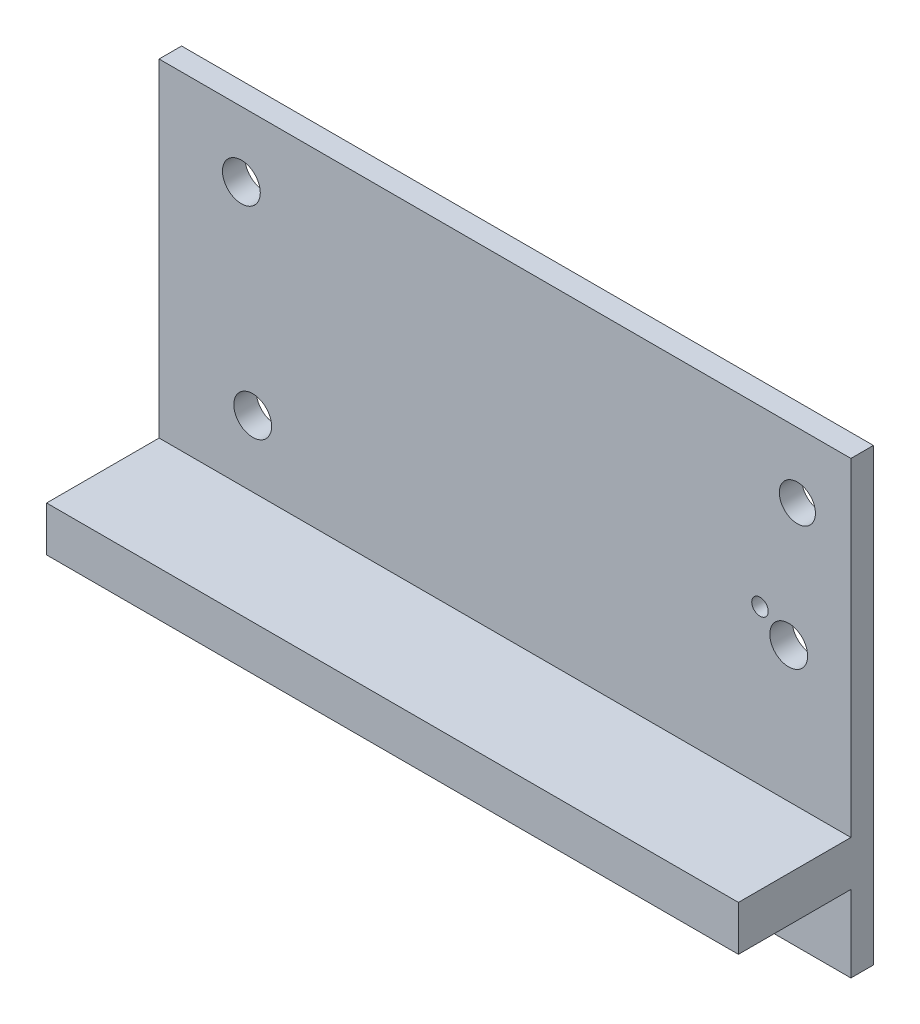
ISO-10303-21;
HEADER;
FILE_DESCRIPTION(('STEP AP214'),'2;1');
FILE_NAME('part.step','',(''),(''),'','','');
FILE_SCHEMA(('AUTOMOTIVE_DESIGN { 1 0 10303 214 1 1 1 1 }'));
ENDSEC;
DATA;
#1=APPLICATION_CONTEXT('core data for automotive mechanical design processes');
#2=APPLICATION_PROTOCOL_DEFINITION('international standard','automotive_design',2000,#1);
#3=PRODUCT_CONTEXT('',#1,'mechanical');
#4=PRODUCT('Part','Part','',(#3));
#5=PRODUCT_RELATED_PRODUCT_CATEGORY('part','',(#4));
#6=PRODUCT_DEFINITION_FORMATION('','',#4);
#7=PRODUCT_DEFINITION_CONTEXT('part definition',#1,'design');
#8=PRODUCT_DEFINITION('design','',#6,#7);
#9=PRODUCT_DEFINITION_SHAPE('','',#8);
#10=(LENGTH_UNIT() NAMED_UNIT(*) SI_UNIT(.MILLI.,.METRE.));
#11=(NAMED_UNIT(*) PLANE_ANGLE_UNIT() SI_UNIT($,.RADIAN.));
#12=(NAMED_UNIT(*) SI_UNIT($,.STERADIAN.) SOLID_ANGLE_UNIT());
#13=UNCERTAINTY_MEASURE_WITH_UNIT(LENGTH_MEASURE(1.E-05),#10,'distance_accuracy_value','');
#14=(GEOMETRIC_REPRESENTATION_CONTEXT(3) GLOBAL_UNCERTAINTY_ASSIGNED_CONTEXT((#13)) GLOBAL_UNIT_ASSIGNED_CONTEXT((#10,
#11,#12)) REPRESENTATION_CONTEXT('',''));
#15=CARTESIAN_POINT('',(0.,0.,0.));
#16=DIRECTION('',(0.,0.,1.));
#17=DIRECTION('',(1.,0.,0.));
#18=AXIS2_PLACEMENT_3D('',#15,#16,#17);
#19=CARTESIAN_POINT('',(0.,0.,0.));
#20=DIRECTION('',(0.,0.,-1.));
#21=DIRECTION('',(-1.,0.,0.));
#22=AXIS2_PLACEMENT_3D('',#19,#20,#21);
#23=PLANE('',#22);
#24=DIRECTION('',(1.,0.,0.));
#25=VECTOR('',#24,1.);
#26=CARTESIAN_POINT('',(21.7033479692886,-62.0450293973224,0.));
#27=LINE('',#26,#25);
#28=CARTESIAN_POINT('',(21.7033479692886,-62.0450293973224,0.));
#29=VERTEX_POINT('',#28);
#30=CARTESIAN_POINT('',(83.201750722126,-62.0450293973224,0.));
#31=VERTEX_POINT('',#30);
#32=EDGE_CURVE('E50',#29,#31,#27,.T.);
#33=ORIENTED_EDGE('',*,*,#32,.F.);
#34=DIRECTION('',(0.,-1.,0.));
#35=VECTOR('',#34,1.);
#36=CARTESIAN_POINT('',(21.7033479692886,-28.8650293973223,0.));
#37=LINE('',#36,#35);
#38=CARTESIAN_POINT('',(21.7033479692886,-68.8650293973223,0.));
#39=VERTEX_POINT('',#38);
#40=EDGE_CURVE('E203',#29,#39,#37,.T.);
#41=ORIENTED_EDGE('',*,*,#40,.T.);
#42=DIRECTION('',(1.,0.,0.));
#43=VECTOR('',#42,1.);
#44=CARTESIAN_POINT('',(83.201750722126,-68.8650293973223,0.));
#45=LINE('',#44,#43);
#46=CARTESIAN_POINT('',(83.201750722126,-68.8650293973223,0.));
#47=VERTEX_POINT('',#46);
#48=EDGE_CURVE('E173',#39,#47,#45,.T.);
#49=ORIENTED_EDGE('',*,*,#48,.T.);
#50=DIRECTION('',(0.,1.,0.));
#51=VECTOR('',#50,1.);
#52=CARTESIAN_POINT('',(83.201750722126,-28.8650293973223,0.));
#53=LINE('',#52,#51);
#54=EDGE_CURVE('E191',#47,#31,#53,.T.);
#55=ORIENTED_EDGE('',*,*,#54,.T.);
#56=EDGE_LOOP('',(#33,#41,#49,#55));
#57=FACE_BOUND('',#56,.T.);
#58=ADVANCED_FACE('F33',(#57),#23,.F.);
#59=CARTESIAN_POINT('',(78.4431489365496,-34.6698481646586,0.));
#60=DIRECTION('',(0.,0.,1.));
#61=DIRECTION('',(1.,0.,0.));
#62=AXIS2_PLACEMENT_3D('',#59,#60,#61);
#63=CIRCLE('',#62,1.60561890610046);
#64=CARTESIAN_POINT('',(80.04876784265,-34.6698481646586,0.));
#65=VERTEX_POINT('',#64);
#66=EDGE_CURVE('E161',#65,#65,#63,.T.);
#67=ORIENTED_EDGE('',*,*,#66,.F.);
#68=EDGE_LOOP('',(#67));
#69=FACE_BOUND('',#68,.T.);
#70=CARTESIAN_POINT('',(77.6721202822906,-46.0004483659014,0.));
#71=DIRECTION('',(0.,0.,1.));
#72=DIRECTION('',(1.,0.,0.));
#73=AXIS2_PLACEMENT_3D('',#70,#71,#72);
#74=CIRCLE('',#73,1.68044706697463);
#75=CARTESIAN_POINT('',(79.3525673492653,-46.0004483659014,0.));
#76=VERTEX_POINT('',#75);
#77=EDGE_CURVE('E155',#76,#76,#74,.T.);
#78=ORIENTED_EDGE('',*,*,#77,.F.);
#79=EDGE_LOOP('',(#78));
#80=FACE_BOUND('',#79,.T.);
#81=CARTESIAN_POINT('',(29.0182352020017,-34.6698481646586,0.));
#82=DIRECTION('',(0.,0.,1.));
#83=DIRECTION('',(1.,0.,0.));
#84=AXIS2_PLACEMENT_3D('',#81,#82,#83);
#85=CIRCLE('',#84,1.68044706697463);
#86=CARTESIAN_POINT('',(30.6986822689763,-34.6698481646586,0.));
#87=VERTEX_POINT('',#86);
#88=EDGE_CURVE('E149',#87,#87,#85,.T.);
#89=ORIENTED_EDGE('',*,*,#88,.F.);
#90=EDGE_LOOP('',(#89));
#91=FACE_BOUND('',#90,.T.);
#92=CARTESIAN_POINT('',(30.0265034421865,-52.1489076344791,0.));
#93=DIRECTION('',(0.,0.,1.));
#94=DIRECTION('',(1.,0.,0.));
#95=AXIS2_PLACEMENT_3D('',#92,#93,#94);
#96=CIRCLE('',#95,1.68044706697463);
#97=CARTESIAN_POINT('',(31.7069505091611,-52.1489076344791,0.));
#98=VERTEX_POINT('',#97);
#99=EDGE_CURVE('E144',#98,#98,#96,.T.);
#100=ORIENTED_EDGE('',*,*,#99,.F.);
#101=EDGE_LOOP('',(#100));
#102=FACE_BOUND('',#101,.T.);
#103=CARTESIAN_POINT('',(75.1189441621747,-44.3200012989267,0.));
#104=DIRECTION('',(0.,0.,1.));
#105=DIRECTION('',(1.,0.,0.));
#106=AXIS2_PLACEMENT_3D('',#103,#104,#105);
#107=CIRCLE('',#106,0.733091197068774);
#108=CARTESIAN_POINT('',(75.8520353592435,-44.3200012989267,0.));
#109=VERTEX_POINT('',#108);
#110=EDGE_CURVE('E122',#109,#109,#107,.T.);
#111=ORIENTED_EDGE('',*,*,#110,.F.);
#112=EDGE_LOOP('',(#111));
#113=FACE_BOUND('',#112,.T.);
#114=DIRECTION('',(-1.,0.,0.));
#115=VECTOR('',#114,1.);
#116=CARTESIAN_POINT('',(21.7033479692886,-58.0450293973224,0.));
#117=LINE('',#116,#115);
#118=CARTESIAN_POINT('',(83.201750722126,-58.0450293973224,0.));
#119=VERTEX_POINT('',#118);
#120=CARTESIAN_POINT('',(21.7033479692886,-58.0450293973224,0.));
#121=VERTEX_POINT('',#120);
#122=EDGE_CURVE('E58',#119,#121,#117,.T.);
#123=ORIENTED_EDGE('',*,*,#122,.F.);
#124=CARTESIAN_POINT('',(83.201750722126,-28.8650293973223,0.));
#125=VERTEX_POINT('',#124);
#126=EDGE_CURVE('E121',#119,#125,#53,.T.);
#127=ORIENTED_EDGE('',*,*,#126,.T.);
#128=DIRECTION('',(-1.,0.,0.));
#129=VECTOR('',#128,1.);
#130=CARTESIAN_POINT('',(83.201750722126,-28.8650293973223,0.));
#131=LINE('',#130,#129);
#132=CARTESIAN_POINT('',(21.7033479692886,-28.8650293973223,0.));
#133=VERTEX_POINT('',#132);
#134=EDGE_CURVE('E185',#125,#133,#131,.T.);
#135=ORIENTED_EDGE('',*,*,#134,.T.);
#136=EDGE_CURVE('E199',#133,#121,#37,.T.);
#137=ORIENTED_EDGE('',*,*,#136,.T.);
#138=EDGE_LOOP('',(#123,#127,#135,#137));
#139=FACE_BOUND('',#138,.T.);
#140=ADVANCED_FACE('F208',(#69,#80,#91,#102,#113,#139),#23,.F.);
#141=CARTESIAN_POINT('',(83.201750722126,-28.8650293973223,-2.));
#142=DIRECTION('',(1.,0.,0.));
#143=DIRECTION('',(0.,0.,-1.));
#144=AXIS2_PLACEMENT_3D('',#141,#142,#143);
#145=PLANE('',#144);
#146=ORIENTED_EDGE('',*,*,#54,.F.);
#147=DIRECTION('',(0.,0.,1.));
#148=VECTOR('',#147,1.);
#149=CARTESIAN_POINT('',(83.201750722126,-68.8650293973223,-2.));
#150=LINE('',#149,#148);
#151=CARTESIAN_POINT('',(83.201750722126,-68.8650293973223,-2.));
#152=VERTEX_POINT('',#151);
#153=EDGE_CURVE('E11',#152,#47,#150,.T.);
#154=ORIENTED_EDGE('',*,*,#153,.F.);
#155=DIRECTION('',(0.,1.,0.));
#156=VECTOR('',#155,1.);
#157=CARTESIAN_POINT('',(83.201750722126,-28.8650293973223,-2.));
#158=LINE('',#157,#156);
#159=CARTESIAN_POINT('',(83.201750722126,-28.8650293973223,-2.));
#160=VERTEX_POINT('',#159);
#161=EDGE_CURVE('E169',#152,#160,#158,.T.);
#162=ORIENTED_EDGE('',*,*,#161,.T.);
#163=DIRECTION('',(0.,0.,1.));
#164=VECTOR('',#163,1.);
#165=CARTESIAN_POINT('',(83.201750722126,-28.8650293973223,-2.));
#166=LINE('',#165,#164);
#167=EDGE_CURVE('E182',#160,#125,#166,.T.);
#168=ORIENTED_EDGE('',*,*,#167,.T.);
#169=ORIENTED_EDGE('',*,*,#126,.F.);
#170=DIRECTION('',(0.,0.,-1.));
#171=VECTOR('',#170,1.);
#172=CARTESIAN_POINT('',(83.201750722126,-58.0450293973224,10.));
#173=LINE('',#172,#171);
#174=CARTESIAN_POINT('',(83.201750722126,-58.0450293973224,10.));
#175=VERTEX_POINT('',#174);
#176=EDGE_CURVE('E103',#175,#119,#173,.T.);
#177=ORIENTED_EDGE('',*,*,#176,.F.);
#178=DIRECTION('',(0.,1.,0.));
#179=VECTOR('',#178,1.);
#180=CARTESIAN_POINT('',(83.201750722126,-62.0450293973224,10.));
#181=LINE('',#180,#179);
#182=CARTESIAN_POINT('',(83.201750722126,-62.0450293973224,10.));
#183=VERTEX_POINT('',#182);
#184=EDGE_CURVE('E109',#183,#175,#181,.T.);
#185=ORIENTED_EDGE('',*,*,#184,.F.);
#186=DIRECTION('',(0.,0.,-1.));
#187=VECTOR('',#186,1.);
#188=CARTESIAN_POINT('',(83.201750722126,-62.0450293973224,10.));
#189=LINE('',#188,#187);
#190=EDGE_CURVE('E136',#183,#31,#189,.T.);
#191=ORIENTED_EDGE('',*,*,#190,.T.);
#192=EDGE_LOOP('',(#146,#154,#162,#168,#169,#177,#185,#191));
#193=FACE_BOUND('',#192,.T.);
#194=ADVANCED_FACE('F35',(#193),#145,.T.);
#195=CARTESIAN_POINT('',(83.201750722126,-68.8650293973223,-2.));
#196=DIRECTION('',(0.,-1.,0.));
#197=DIRECTION('',(1.,0.,0.));
#198=AXIS2_PLACEMENT_3D('',#195,#196,#197);
#199=PLANE('',#198);
#200=ORIENTED_EDGE('',*,*,#48,.F.);
#201=DIRECTION('',(0.,0.,1.));
#202=VECTOR('',#201,1.);
#203=CARTESIAN_POINT('',(21.7033479692886,-68.8650293973223,-2.));
#204=LINE('',#203,#202);
#205=CARTESIAN_POINT('',(21.7033479692886,-68.8650293973223,-2.));
#206=VERTEX_POINT('',#205);
#207=EDGE_CURVE('E42',#206,#39,#204,.T.);
#208=ORIENTED_EDGE('',*,*,#207,.F.);
#209=DIRECTION('',(1.,0.,0.));
#210=VECTOR('',#209,1.);
#211=CARTESIAN_POINT('',(83.201750722126,-68.8650293973223,-2.));
#212=LINE('',#211,#210);
#213=EDGE_CURVE('E179',#206,#152,#212,.T.);
#214=ORIENTED_EDGE('',*,*,#213,.T.);
#215=ORIENTED_EDGE('',*,*,#153,.T.);
#216=EDGE_LOOP('',(#200,#208,#214,#215));
#217=FACE_BOUND('',#216,.T.);
#218=ADVANCED_FACE('F240',(#217),#199,.T.);
#219=CARTESIAN_POINT('',(21.7033479692886,-28.8650293973223,-2.));
#220=DIRECTION('',(-1.,0.,0.));
#221=DIRECTION('',(0.,0.,1.));
#222=AXIS2_PLACEMENT_3D('',#219,#220,#221);
#223=PLANE('',#222);
#224=ORIENTED_EDGE('',*,*,#136,.F.);
#225=DIRECTION('',(0.,0.,1.));
#226=VECTOR('',#225,1.);
#227=CARTESIAN_POINT('',(21.7033479692886,-28.8650293973223,-2.));
#228=LINE('',#227,#226);
#229=CARTESIAN_POINT('',(21.7033479692886,-28.8650293973223,-2.));
#230=VERTEX_POINT('',#229);
#231=EDGE_CURVE('E194',#230,#133,#228,.T.);
#232=ORIENTED_EDGE('',*,*,#231,.F.);
#233=DIRECTION('',(0.,-1.,0.));
#234=VECTOR('',#233,1.);
#235=CARTESIAN_POINT('',(21.7033479692886,-28.8650293973223,-2.));
#236=LINE('',#235,#234);
#237=EDGE_CURVE('E176',#230,#206,#236,.T.);
#238=ORIENTED_EDGE('',*,*,#237,.T.);
#239=ORIENTED_EDGE('',*,*,#207,.T.);
#240=ORIENTED_EDGE('',*,*,#40,.F.);
#241=DIRECTION('',(0.,0.,-1.));
#242=VECTOR('',#241,1.);
#243=CARTESIAN_POINT('',(21.7033479692886,-62.0450293973224,10.));
#244=LINE('',#243,#242);
#245=CARTESIAN_POINT('',(21.7033479692886,-62.0450293973224,10.));
#246=VERTEX_POINT('',#245);
#247=EDGE_CURVE('E127',#246,#29,#244,.T.);
#248=ORIENTED_EDGE('',*,*,#247,.F.);
#249=DIRECTION('',(0.,-1.,0.));
#250=VECTOR('',#249,1.);
#251=CARTESIAN_POINT('',(21.7033479692886,-62.0450293973224,10.));
#252=LINE('',#251,#250);
#253=CARTESIAN_POINT('',(21.7033479692886,-58.0450293973224,10.));
#254=VERTEX_POINT('',#253);
#255=EDGE_CURVE('E108',#254,#246,#252,.T.);
#256=ORIENTED_EDGE('',*,*,#255,.F.);
#257=DIRECTION('',(0.,0.,-1.));
#258=VECTOR('',#257,1.);
#259=CARTESIAN_POINT('',(21.7033479692886,-58.0450293973224,10.));
#260=LINE('',#259,#258);
#261=EDGE_CURVE('E105',#254,#121,#260,.T.);
#262=ORIENTED_EDGE('',*,*,#261,.T.);
#263=EDGE_LOOP('',(#224,#232,#238,#239,#240,#248,#256,#262));
#264=FACE_BOUND('',#263,.T.);
#265=ADVANCED_FACE('F214',(#264),#223,.T.);
#266=CARTESIAN_POINT('',(83.201750722126,-28.8650293973223,-2.));
#267=DIRECTION('',(0.,1.,0.));
#268=DIRECTION('',(0.,0.,1.));
#269=AXIS2_PLACEMENT_3D('',#266,#267,#268);
#270=PLANE('',#269);
#271=ORIENTED_EDGE('',*,*,#134,.F.);
#272=ORIENTED_EDGE('',*,*,#167,.F.);
#273=DIRECTION('',(-1.,0.,0.));
#274=VECTOR('',#273,1.);
#275=CARTESIAN_POINT('',(83.201750722126,-28.8650293973223,-2.));
#276=LINE('',#275,#274);
#277=EDGE_CURVE('E172',#160,#230,#276,.T.);
#278=ORIENTED_EDGE('',*,*,#277,.T.);
#279=ORIENTED_EDGE('',*,*,#231,.T.);
#280=EDGE_LOOP('',(#271,#272,#278,#279));
#281=FACE_BOUND('',#280,.T.);
#282=ADVANCED_FACE('F210',(#281),#270,.T.);
#283=CARTESIAN_POINT('',(0.,0.,-2.));
#284=DIRECTION('',(0.,0.,-1.));
#285=DIRECTION('',(-1.,0.,0.));
#286=AXIS2_PLACEMENT_3D('',#283,#284,#285);
#287=PLANE('',#286);
#288=CARTESIAN_POINT('',(75.1189441621747,-44.3200012989267,-2.));
#289=DIRECTION('',(0.,0.,1.));
#290=DIRECTION('',(1.,0.,0.));
#291=AXIS2_PLACEMENT_3D('',#288,#289,#290);
#292=CIRCLE('',#291,0.733091197068774);
#293=CARTESIAN_POINT('',(75.8520353592435,-44.3200012989267,-2.));
#294=VERTEX_POINT('',#293);
#295=EDGE_CURVE('E125',#294,#294,#292,.T.);
#296=ORIENTED_EDGE('',*,*,#295,.T.);
#297=EDGE_LOOP('',(#296));
#298=FACE_BOUND('',#297,.T.);
#299=CARTESIAN_POINT('',(30.0265034421865,-52.1489076344791,-2.));
#300=DIRECTION('',(0.,0.,1.));
#301=DIRECTION('',(1.,0.,0.));
#302=AXIS2_PLACEMENT_3D('',#299,#300,#301);
#303=CIRCLE('',#302,1.68044706697463);
#304=CARTESIAN_POINT('',(31.7069505091611,-52.1489076344791,-2.));
#305=VERTEX_POINT('',#304);
#306=EDGE_CURVE('E146',#305,#305,#303,.T.);
#307=ORIENTED_EDGE('',*,*,#306,.T.);
#308=EDGE_LOOP('',(#307));
#309=FACE_BOUND('',#308,.T.);
#310=CARTESIAN_POINT('',(29.0182352020017,-34.6698481646586,-2.));
#311=DIRECTION('',(0.,0.,1.));
#312=DIRECTION('',(1.,0.,0.));
#313=AXIS2_PLACEMENT_3D('',#310,#311,#312);
#314=CIRCLE('',#313,1.68044706697463);
#315=CARTESIAN_POINT('',(30.6986822689763,-34.6698481646586,-2.));
#316=VERTEX_POINT('',#315);
#317=EDGE_CURVE('E152',#316,#316,#314,.T.);
#318=ORIENTED_EDGE('',*,*,#317,.T.);
#319=EDGE_LOOP('',(#318));
#320=FACE_BOUND('',#319,.T.);
#321=CARTESIAN_POINT('',(77.6721202822906,-46.0004483659014,-2.));
#322=DIRECTION('',(0.,0.,1.));
#323=DIRECTION('',(1.,0.,0.));
#324=AXIS2_PLACEMENT_3D('',#321,#322,#323);
#325=CIRCLE('',#324,1.68044706697463);
#326=CARTESIAN_POINT('',(79.3525673492653,-46.0004483659014,-2.));
#327=VERTEX_POINT('',#326);
#328=EDGE_CURVE('E158',#327,#327,#325,.T.);
#329=ORIENTED_EDGE('',*,*,#328,.T.);
#330=EDGE_LOOP('',(#329));
#331=FACE_BOUND('',#330,.T.);
#332=CARTESIAN_POINT('',(78.4431489365496,-34.6698481646586,-2.));
#333=DIRECTION('',(0.,0.,1.));
#334=DIRECTION('',(1.,0.,0.));
#335=AXIS2_PLACEMENT_3D('',#332,#333,#334);
#336=CIRCLE('',#335,1.60561890610046);
#337=CARTESIAN_POINT('',(80.04876784265,-34.6698481646586,-2.));
#338=VERTEX_POINT('',#337);
#339=EDGE_CURVE('E164',#338,#338,#336,.T.);
#340=ORIENTED_EDGE('',*,*,#339,.T.);
#341=EDGE_LOOP('',(#340));
#342=FACE_BOUND('',#341,.T.);
#343=ORIENTED_EDGE('',*,*,#161,.F.);
#344=ORIENTED_EDGE('',*,*,#213,.F.);
#345=ORIENTED_EDGE('',*,*,#237,.F.);
#346=ORIENTED_EDGE('',*,*,#277,.F.);
#347=EDGE_LOOP('',(#343,#344,#345,#346));
#348=FACE_BOUND('',#347,.T.);
#349=ADVANCED_FACE('F238',(#298,#309,#320,#331,#342,#348),#287,.T.);
#350=CARTESIAN_POINT('',(78.4431489365496,-34.6698481646586,-2.));
#351=DIRECTION('',(0.,0.,1.));
#352=DIRECTION('',(1.,0.,0.));
#353=AXIS2_PLACEMENT_3D('',#350,#351,#352);
#354=CYLINDRICAL_SURFACE('',#353,1.60561890610046);
#355=ORIENTED_EDGE('',*,*,#339,.F.);
#356=EDGE_LOOP('',(#355));
#357=FACE_BOUND('',#356,.T.);
#358=ORIENTED_EDGE('',*,*,#66,.T.);
#359=EDGE_LOOP('',(#358));
#360=FACE_BOUND('',#359,.T.);
#361=ADVANCED_FACE('F249',(#357,#360),#354,.F.);
#362=CARTESIAN_POINT('',(77.6721202822906,-46.0004483659014,-2.));
#363=DIRECTION('',(0.,0.,1.));
#364=DIRECTION('',(1.,0.,0.));
#365=AXIS2_PLACEMENT_3D('',#362,#363,#364);
#366=CYLINDRICAL_SURFACE('',#365,1.68044706697463);
#367=ORIENTED_EDGE('',*,*,#328,.F.);
#368=EDGE_LOOP('',(#367));
#369=FACE_BOUND('',#368,.T.);
#370=ORIENTED_EDGE('',*,*,#77,.T.);
#371=EDGE_LOOP('',(#370));
#372=FACE_BOUND('',#371,.T.);
#373=ADVANCED_FACE('F254',(#369,#372),#366,.F.);
#374=CARTESIAN_POINT('',(29.0182352020017,-34.6698481646586,-2.));
#375=DIRECTION('',(0.,0.,1.));
#376=DIRECTION('',(1.,0.,0.));
#377=AXIS2_PLACEMENT_3D('',#374,#375,#376);
#378=CYLINDRICAL_SURFACE('',#377,1.68044706697463);
#379=ORIENTED_EDGE('',*,*,#317,.F.);
#380=EDGE_LOOP('',(#379));
#381=FACE_BOUND('',#380,.T.);
#382=ORIENTED_EDGE('',*,*,#88,.T.);
#383=EDGE_LOOP('',(#382));
#384=FACE_BOUND('',#383,.T.);
#385=ADVANCED_FACE('F287',(#381,#384),#378,.F.);
#386=CARTESIAN_POINT('',(30.0265034421865,-52.1489076344791,-2.));
#387=DIRECTION('',(0.,0.,1.));
#388=DIRECTION('',(1.,0.,0.));
#389=AXIS2_PLACEMENT_3D('',#386,#387,#388);
#390=CYLINDRICAL_SURFACE('',#389,1.68044706697463);
#391=ORIENTED_EDGE('',*,*,#306,.F.);
#392=EDGE_LOOP('',(#391));
#393=FACE_BOUND('',#392,.T.);
#394=ORIENTED_EDGE('',*,*,#99,.T.);
#395=EDGE_LOOP('',(#394));
#396=FACE_BOUND('',#395,.T.);
#397=ADVANCED_FACE('F281',(#393,#396),#390,.F.);
#398=CARTESIAN_POINT('',(75.1189441621747,-44.3200012989267,-2.));
#399=DIRECTION('',(0.,0.,1.));
#400=DIRECTION('',(1.,0.,0.));
#401=AXIS2_PLACEMENT_3D('',#398,#399,#400);
#402=CYLINDRICAL_SURFACE('',#401,0.733091197068774);
#403=ORIENTED_EDGE('',*,*,#295,.F.);
#404=EDGE_LOOP('',(#403));
#405=FACE_BOUND('',#404,.T.);
#406=ORIENTED_EDGE('',*,*,#110,.T.);
#407=EDGE_LOOP('',(#406));
#408=FACE_BOUND('',#407,.T.);
#409=ADVANCED_FACE('F228',(#405,#408),#402,.F.);
#410=CARTESIAN_POINT('',(21.7033479692886,-58.0450293973224,10.));
#411=DIRECTION('',(0.,-1.,0.));
#412=DIRECTION('',(0.,0.,-1.));
#413=AXIS2_PLACEMENT_3D('',#410,#411,#412);
#414=PLANE('',#413);
#415=ORIENTED_EDGE('',*,*,#122,.T.);
#416=ORIENTED_EDGE('',*,*,#261,.F.);
#417=DIRECTION('',(-1.,0.,0.));
#418=VECTOR('',#417,1.);
#419=CARTESIAN_POINT('',(21.7033479692886,-58.0450293973224,10.));
#420=LINE('',#419,#418);
#421=EDGE_CURVE('E99',#175,#254,#420,.T.);
#422=ORIENTED_EDGE('',*,*,#421,.F.);
#423=ORIENTED_EDGE('',*,*,#176,.T.);
#424=EDGE_LOOP('',(#415,#416,#422,#423));
#425=FACE_BOUND('',#424,.T.);
#426=ADVANCED_FACE('F101',(#425),#414,.F.);
#427=CARTESIAN_POINT('',(21.7033479692886,-62.0450293973224,10.));
#428=DIRECTION('',(0.,1.,0.));
#429=DIRECTION('',(-1.,0.,0.));
#430=AXIS2_PLACEMENT_3D('',#427,#428,#429);
#431=PLANE('',#430);
#432=ORIENTED_EDGE('',*,*,#32,.T.);
#433=ORIENTED_EDGE('',*,*,#190,.F.);
#434=DIRECTION('',(1.,0.,0.));
#435=VECTOR('',#434,1.);
#436=CARTESIAN_POINT('',(21.7033479692886,-62.0450293973224,10.));
#437=LINE('',#436,#435);
#438=EDGE_CURVE('E114',#246,#183,#437,.T.);
#439=ORIENTED_EDGE('',*,*,#438,.F.);
#440=ORIENTED_EDGE('',*,*,#247,.T.);
#441=EDGE_LOOP('',(#432,#433,#439,#440));
#442=FACE_BOUND('',#441,.T.);
#443=ADVANCED_FACE('F220',(#442),#431,.F.);
#444=CARTESIAN_POINT('',(0.,0.,10.));
#445=DIRECTION('',(0.,0.,-1.));
#446=DIRECTION('',(-1.,0.,0.));
#447=AXIS2_PLACEMENT_3D('',#444,#445,#446);
#448=PLANE('',#447);
#449=ORIENTED_EDGE('',*,*,#184,.T.);
#450=ORIENTED_EDGE('',*,*,#421,.T.);
#451=ORIENTED_EDGE('',*,*,#255,.T.);
#452=ORIENTED_EDGE('',*,*,#438,.T.);
#453=EDGE_LOOP('',(#449,#450,#451,#452));
#454=FACE_BOUND('',#453,.T.);
#455=ADVANCED_FACE('F112',(#454),#448,.F.);
#456=CLOSED_SHELL('',(#58,#140,#194,#218,#265,#282,#349,#361,#373,#385,#397,#409,#426,#443,#455));
#457=MANIFOLD_SOLID_BREP('B2',#456);
#458=ADVANCED_BREP_SHAPE_REPRESENTATION('',(#18,#457),#14);
#459=SHAPE_DEFINITION_REPRESENTATION(#9,#458);
ENDSEC;
END-ISO-10303-21;
